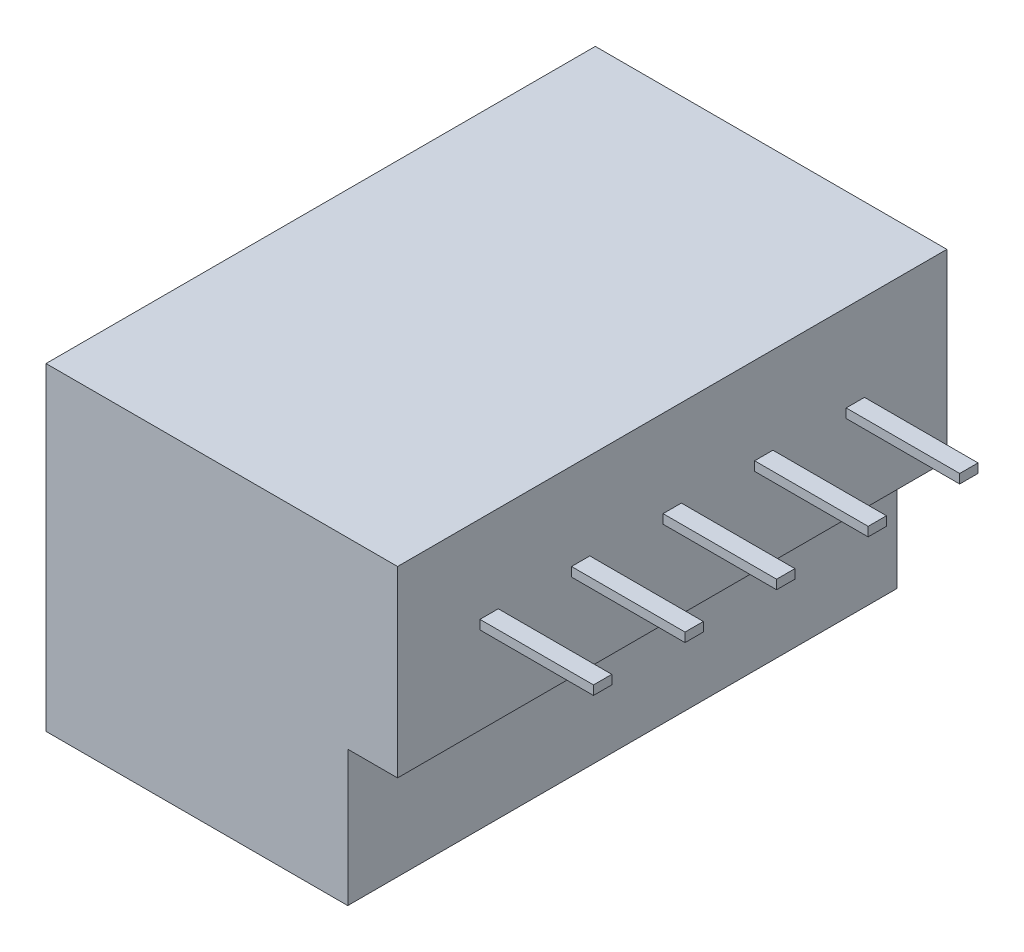
ISO-10303-21;
HEADER;
FILE_DESCRIPTION(('STEP AP214'),'2;1');
FILE_NAME('part.step','',(''),(''),'','','');
FILE_SCHEMA(('AUTOMOTIVE_DESIGN { 1 0 10303 214 1 1 1 1 }'));
ENDSEC;
DATA;
#1=APPLICATION_CONTEXT('core data for automotive mechanical design processes');
#2=APPLICATION_PROTOCOL_DEFINITION('international standard','automotive_design',2000,#1);
#3=PRODUCT_CONTEXT('',#1,'mechanical');
#4=PRODUCT('Part','Part','',(#3));
#5=PRODUCT_RELATED_PRODUCT_CATEGORY('part','',(#4));
#6=PRODUCT_DEFINITION_FORMATION('','',#4);
#7=PRODUCT_DEFINITION_CONTEXT('part definition',#1,'design');
#8=PRODUCT_DEFINITION('design','',#6,#7);
#9=PRODUCT_DEFINITION_SHAPE('','',#8);
#10=(LENGTH_UNIT() NAMED_UNIT(*) SI_UNIT(.MILLI.,.METRE.));
#11=(NAMED_UNIT(*) PLANE_ANGLE_UNIT() SI_UNIT($,.RADIAN.));
#12=(NAMED_UNIT(*) SI_UNIT($,.STERADIAN.) SOLID_ANGLE_UNIT());
#13=UNCERTAINTY_MEASURE_WITH_UNIT(LENGTH_MEASURE(1.E-05),#10,'distance_accuracy_value','');
#14=(GEOMETRIC_REPRESENTATION_CONTEXT(3) GLOBAL_UNCERTAINTY_ASSIGNED_CONTEXT((#13)) GLOBAL_UNIT_ASSIGNED_CONTEXT((#10,
#11,#12)) REPRESENTATION_CONTEXT('',''));
#15=CARTESIAN_POINT('',(0.,0.,0.));
#16=DIRECTION('',(0.,0.,1.));
#17=DIRECTION('',(1.,0.,0.));
#18=AXIS2_PLACEMENT_3D('',#15,#16,#17);
#19=CARTESIAN_POINT('',(-10.756881088162,8.7,-6.7780596006196));
#20=DIRECTION('',(-1.,0.,0.));
#21=DIRECTION('',(0.,0.,1.));
#22=AXIS2_PLACEMENT_3D('',#19,#20,#21);
#23=PLANE('',#22);
#24=DIRECTION('',(0.,-1.,0.));
#25=VECTOR('',#24,1.);
#26=CARTESIAN_POINT('',(-10.756881088162,6.325,-1.5280596006196));
#27=LINE('',#26,#25);
#28=CARTESIAN_POINT('',(-10.756881088162,6.325,-1.5280596006196));
#29=VERTEX_POINT('',#28);
#30=CARTESIAN_POINT('',(-10.756881088162,6.075,-1.5280596006196));
#31=VERTEX_POINT('',#30);
#32=EDGE_CURVE('E230',#29,#31,#27,.T.);
#33=ORIENTED_EDGE('',*,*,#32,.F.);
#34=DIRECTION('',(0.,0.,1.));
#35=VECTOR('',#34,1.);
#36=CARTESIAN_POINT('',(-10.756881088162,6.325,-1.5280596006196));
#37=LINE('',#36,#35);
#38=CARTESIAN_POINT('',(-10.756881088162,6.325,-2.0280596006196));
#39=VERTEX_POINT('',#38);
#40=EDGE_CURVE('E243',#39,#29,#37,.T.);
#41=ORIENTED_EDGE('',*,*,#40,.F.);
#42=DIRECTION('',(0.,1.,0.));
#43=VECTOR('',#42,1.);
#44=CARTESIAN_POINT('',(-10.756881088162,6.325,-2.0280596006196));
#45=LINE('',#44,#43);
#46=CARTESIAN_POINT('',(-10.756881088162,6.075,-2.0280596006196));
#47=VERTEX_POINT('',#46);
#48=EDGE_CURVE('E252',#47,#39,#45,.T.);
#49=ORIENTED_EDGE('',*,*,#48,.F.);
#50=DIRECTION('',(0.,0.,-1.));
#51=VECTOR('',#50,1.);
#52=CARTESIAN_POINT('',(-10.756881088162,6.075,-1.5280596006196));
#53=LINE('',#52,#51);
#54=EDGE_CURVE('E233',#31,#47,#53,.T.);
#55=ORIENTED_EDGE('',*,*,#54,.F.);
#56=EDGE_LOOP('',(#33,#41,#49,#55));
#57=FACE_BOUND('',#56,.T.);
#58=DIRECTION('',(0.,-1.,0.));
#59=VECTOR('',#58,1.);
#60=CARTESIAN_POINT('',(-10.756881088162,6.325,3.4719403993804));
#61=LINE('',#60,#59);
#62=CARTESIAN_POINT('',(-10.756881088162,6.325,3.4719403993804));
#63=VERTEX_POINT('',#62);
#64=CARTESIAN_POINT('',(-10.756881088162,6.075,3.4719403993804));
#65=VERTEX_POINT('',#64);
#66=EDGE_CURVE('E301',#63,#65,#61,.T.);
#67=ORIENTED_EDGE('',*,*,#66,.F.);
#68=DIRECTION('',(0.,0.,1.));
#69=VECTOR('',#68,1.);
#70=CARTESIAN_POINT('',(-10.756881088162,6.325,3.4719403993804));
#71=LINE('',#70,#69);
#72=CARTESIAN_POINT('',(-10.756881088162,6.325,2.9719403993804));
#73=VERTEX_POINT('',#72);
#74=EDGE_CURVE('E306',#73,#63,#71,.T.);
#75=ORIENTED_EDGE('',*,*,#74,.F.);
#76=DIRECTION('',(0.,1.,0.));
#77=VECTOR('',#76,1.);
#78=CARTESIAN_POINT('',(-10.756881088162,6.325,2.9719403993804));
#79=LINE('',#78,#77);
#80=CARTESIAN_POINT('',(-10.756881088162,6.075,2.9719403993804));
#81=VERTEX_POINT('',#80);
#82=EDGE_CURVE('E318',#81,#73,#79,.T.);
#83=ORIENTED_EDGE('',*,*,#82,.F.);
#84=DIRECTION('',(0.,0.,-1.));
#85=VECTOR('',#84,1.);
#86=CARTESIAN_POINT('',(-10.756881088162,6.075,3.4719403993804));
#87=LINE('',#86,#85);
#88=EDGE_CURVE('E315',#65,#81,#87,.T.);
#89=ORIENTED_EDGE('',*,*,#88,.F.);
#90=EDGE_LOOP('',(#67,#75,#83,#89));
#91=FACE_BOUND('',#90,.T.);
#92=DIRECTION('',(0.,0.,-1.));
#93=VECTOR('',#92,1.);
#94=CARTESIAN_POINT('',(-10.756881088162,3.7,-6.7780596006196));
#95=LINE('',#94,#93);
#96=CARTESIAN_POINT('',(-10.756881088162,3.7,8.2219403993804));
#97=VERTEX_POINT('',#96);
#98=CARTESIAN_POINT('',(-10.756881088162,3.7,-6.7780596006196));
#99=VERTEX_POINT('',#98);
#100=EDGE_CURVE('E382',#97,#99,#95,.T.);
#101=ORIENTED_EDGE('',*,*,#100,.T.);
#102=DIRECTION('',(0.,-1.,0.));
#103=VECTOR('',#102,1.);
#104=CARTESIAN_POINT('',(-10.756881088162,8.7,-6.7780596006196));
#105=LINE('',#104,#103);
#106=CARTESIAN_POINT('',(-10.756881088162,8.7,-6.7780596006196));
#107=VERTEX_POINT('',#106);
#108=EDGE_CURVE('E379',#107,#99,#105,.T.);
#109=ORIENTED_EDGE('',*,*,#108,.F.);
#110=DIRECTION('',(0.,0.,-1.));
#111=VECTOR('',#110,1.);
#112=CARTESIAN_POINT('',(-10.756881088162,8.7,-6.7780596006196));
#113=LINE('',#112,#111);
#114=CARTESIAN_POINT('',(-10.756881088162,8.7,8.2219403993804));
#115=VERTEX_POINT('',#114);
#116=EDGE_CURVE('E374',#115,#107,#113,.T.);
#117=ORIENTED_EDGE('',*,*,#116,.F.);
#118=DIRECTION('',(0.,-1.,0.));
#119=VECTOR('',#118,1.);
#120=CARTESIAN_POINT('',(-10.756881088162,8.7,8.2219403993804));
#121=LINE('',#120,#119);
#122=EDGE_CURVE('E417',#115,#97,#121,.T.);
#123=ORIENTED_EDGE('',*,*,#122,.T.);
#124=EDGE_LOOP('',(#101,#109,#117,#123));
#125=FACE_BOUND('',#124,.T.);
#126=DIRECTION('',(0.,-1.,0.));
#127=VECTOR('',#126,1.);
#128=CARTESIAN_POINT('',(-10.756881088162,6.325,5.9719403993804));
#129=LINE('',#128,#127);
#130=CARTESIAN_POINT('',(-10.756881088162,6.325,5.9719403993804));
#131=VERTEX_POINT('',#130);
#132=CARTESIAN_POINT('',(-10.756881088162,6.075,5.9719403993804));
#133=VERTEX_POINT('',#132);
#134=EDGE_CURVE('E334',#131,#133,#129,.T.);
#135=ORIENTED_EDGE('',*,*,#134,.F.);
#136=DIRECTION('',(0.,0.,1.));
#137=VECTOR('',#136,1.);
#138=CARTESIAN_POINT('',(-10.756881088162,6.325,5.9719403993804));
#139=LINE('',#138,#137);
#140=CARTESIAN_POINT('',(-10.756881088162,6.325,5.4719403993804));
#141=VERTEX_POINT('',#140);
#142=EDGE_CURVE('E339',#141,#131,#139,.T.);
#143=ORIENTED_EDGE('',*,*,#142,.F.);
#144=DIRECTION('',(0.,1.,0.));
#145=VECTOR('',#144,1.);
#146=CARTESIAN_POINT('',(-10.756881088162,6.325,5.4719403993804));
#147=LINE('',#146,#145);
#148=CARTESIAN_POINT('',(-10.756881088162,6.075,5.4719403993804));
#149=VERTEX_POINT('',#148);
#150=EDGE_CURVE('E351',#149,#141,#147,.T.);
#151=ORIENTED_EDGE('',*,*,#150,.F.);
#152=DIRECTION('',(0.,0.,-1.));
#153=VECTOR('',#152,1.);
#154=CARTESIAN_POINT('',(-10.756881088162,6.075,5.9719403993804));
#155=LINE('',#154,#153);
#156=EDGE_CURVE('E348',#133,#149,#155,.T.);
#157=ORIENTED_EDGE('',*,*,#156,.F.);
#158=EDGE_LOOP('',(#135,#143,#151,#157));
#159=FACE_BOUND('',#158,.T.);
#160=DIRECTION('',(0.,-1.,0.));
#161=VECTOR('',#160,1.);
#162=CARTESIAN_POINT('',(-10.756881088162,6.325,0.971940399380402));
#163=LINE('',#162,#161);
#164=CARTESIAN_POINT('',(-10.756881088162,6.325,0.971940399380402));
#165=VERTEX_POINT('',#164);
#166=CARTESIAN_POINT('',(-10.756881088162,6.075,0.971940399380402));
#167=VERTEX_POINT('',#166);
#168=EDGE_CURVE('E268',#165,#167,#163,.T.);
#169=ORIENTED_EDGE('',*,*,#168,.F.);
#170=DIRECTION('',(0.,0.,1.));
#171=VECTOR('',#170,1.);
#172=CARTESIAN_POINT('',(-10.756881088162,6.325,0.971940399380402));
#173=LINE('',#172,#171);
#174=CARTESIAN_POINT('',(-10.756881088162,6.325,0.471940399380401));
#175=VERTEX_POINT('',#174);
#176=EDGE_CURVE('E273',#175,#165,#173,.T.);
#177=ORIENTED_EDGE('',*,*,#176,.F.);
#178=DIRECTION('',(0.,1.,0.));
#179=VECTOR('',#178,1.);
#180=CARTESIAN_POINT('',(-10.756881088162,6.325,0.471940399380402));
#181=LINE('',#180,#179);
#182=CARTESIAN_POINT('',(-10.756881088162,6.075,0.471940399380402));
#183=VERTEX_POINT('',#182);
#184=EDGE_CURVE('E285',#183,#175,#181,.T.);
#185=ORIENTED_EDGE('',*,*,#184,.F.);
#186=DIRECTION('',(0.,0.,-1.));
#187=VECTOR('',#186,1.);
#188=CARTESIAN_POINT('',(-10.756881088162,6.075,0.971940399380402));
#189=LINE('',#188,#187);
#190=EDGE_CURVE('E282',#167,#183,#189,.T.);
#191=ORIENTED_EDGE('',*,*,#190,.F.);
#192=EDGE_LOOP('',(#169,#177,#185,#191));
#193=FACE_BOUND('',#192,.T.);
#194=DIRECTION('',(0.,-1.,0.));
#195=VECTOR('',#194,1.);
#196=CARTESIAN_POINT('',(-10.756881088162,6.325,-4.0280596006196));
#197=LINE('',#196,#195);
#198=CARTESIAN_POINT('',(-10.756881088162,6.325,-4.0280596006196));
#199=VERTEX_POINT('',#198);
#200=CARTESIAN_POINT('',(-10.756881088162,6.075,-4.0280596006196));
#201=VERTEX_POINT('',#200);
#202=EDGE_CURVE('E229',#199,#201,#197,.T.);
#203=ORIENTED_EDGE('',*,*,#202,.F.);
#204=DIRECTION('',(0.,0.,1.));
#205=VECTOR('',#204,1.);
#206=CARTESIAN_POINT('',(-10.756881088162,6.325,-4.0280596006196));
#207=LINE('',#206,#205);
#208=CARTESIAN_POINT('',(-10.756881088162,6.325,-4.5280596006196));
#209=VERTEX_POINT('',#208);
#210=EDGE_CURVE('E226',#209,#199,#207,.T.);
#211=ORIENTED_EDGE('',*,*,#210,.F.);
#212=DIRECTION('',(0.,1.,0.));
#213=VECTOR('',#212,1.);
#214=CARTESIAN_POINT('',(-10.756881088162,6.325,-4.5280596006196));
#215=LINE('',#214,#213);
#216=CARTESIAN_POINT('',(-10.756881088162,6.075,-4.5280596006196));
#217=VERTEX_POINT('',#216);
#218=EDGE_CURVE('E56',#217,#209,#215,.T.);
#219=ORIENTED_EDGE('',*,*,#218,.F.);
#220=DIRECTION('',(0.,0.,-1.));
#221=VECTOR('',#220,1.);
#222=CARTESIAN_POINT('',(-10.756881088162,6.075,-4.0280596006196));
#223=LINE('',#222,#221);
#224=EDGE_CURVE('E51',#201,#217,#223,.T.);
#225=ORIENTED_EDGE('',*,*,#224,.F.);
#226=EDGE_LOOP('',(#203,#211,#219,#225));
#227=FACE_BOUND('',#226,.T.);
#228=ADVANCED_FACE('F34',(#57,#91,#125,#159,#193,#227),#23,.F.);
#229=CARTESIAN_POINT('',(-20.356881088162,3.7,-6.7780596006196));
#230=DIRECTION('',(1.,0.,0.));
#231=DIRECTION('',(0.,0.,-1.));
#232=AXIS2_PLACEMENT_3D('',#229,#230,#231);
#233=PLANE('',#232);
#234=DIRECTION('',(0.,0.,1.));
#235=VECTOR('',#234,1.);
#236=CARTESIAN_POINT('',(-20.356881088162,0.,-6.7780596006196));
#237=LINE('',#236,#235);
#238=CARTESIAN_POINT('',(-20.356881088162,0.,-6.7780596006196));
#239=VERTEX_POINT('',#238);
#240=CARTESIAN_POINT('',(-20.356881088162,0.,8.2219403993804));
#241=VERTEX_POINT('',#240);
#242=EDGE_CURVE('E390',#239,#241,#237,.T.);
#243=ORIENTED_EDGE('',*,*,#242,.T.);
#244=DIRECTION('',(0.,-1.,0.));
#245=VECTOR('',#244,1.);
#246=CARTESIAN_POINT('',(-20.356881088162,3.7,8.2219403993804));
#247=LINE('',#246,#245);
#248=CARTESIAN_POINT('',(-20.356881088162,8.7,8.2219403993804));
#249=VERTEX_POINT('',#248);
#250=EDGE_CURVE('E11',#249,#241,#247,.T.);
#251=ORIENTED_EDGE('',*,*,#250,.F.);
#252=DIRECTION('',(0.,0.,1.));
#253=VECTOR('',#252,1.);
#254=CARTESIAN_POINT('',(-20.356881088162,8.7,8.2219403993804));
#255=LINE('',#254,#253);
#256=CARTESIAN_POINT('',(-20.356881088162,8.7,-6.7780596006196));
#257=VERTEX_POINT('',#256);
#258=EDGE_CURVE('E368',#257,#249,#255,.T.);
#259=ORIENTED_EDGE('',*,*,#258,.F.);
#260=DIRECTION('',(0.,-1.,0.));
#261=VECTOR('',#260,1.);
#262=CARTESIAN_POINT('',(-20.356881088162,3.7,-6.7780596006196));
#263=LINE('',#262,#261);
#264=EDGE_CURVE('E396',#257,#239,#263,.T.);
#265=ORIENTED_EDGE('',*,*,#264,.T.);
#266=EDGE_LOOP('',(#243,#251,#259,#265));
#267=FACE_BOUND('',#266,.T.);
#268=ADVANCED_FACE('F36',(#267),#233,.F.);
#269=CARTESIAN_POINT('',(-20.356881088162,3.7,8.2219403993804));
#270=DIRECTION('',(0.,0.,-1.));
#271=DIRECTION('',(-1.,0.,0.));
#272=AXIS2_PLACEMENT_3D('',#269,#270,#271);
#273=PLANE('',#272);
#274=DIRECTION('',(1.,0.,0.));
#275=VECTOR('',#274,1.);
#276=CARTESIAN_POINT('',(-20.356881088162,0.,8.2219403993804));
#277=LINE('',#276,#275);
#278=CARTESIAN_POINT('',(-12.116881088162,0.,8.2219403993804));
#279=VERTEX_POINT('',#278);
#280=EDGE_CURVE('E414',#241,#279,#277,.T.);
#281=ORIENTED_EDGE('',*,*,#280,.T.);
#282=DIRECTION('',(0.,-1.,0.));
#283=VECTOR('',#282,1.);
#284=CARTESIAN_POINT('',(-12.116881088162,3.7,8.2219403993804));
#285=LINE('',#284,#283);
#286=CARTESIAN_POINT('',(-12.116881088162,3.7,8.2219403993804));
#287=VERTEX_POINT('',#286);
#288=EDGE_CURVE('E43',#287,#279,#285,.T.);
#289=ORIENTED_EDGE('',*,*,#288,.F.);
#290=DIRECTION('',(1.,0.,0.));
#291=VECTOR('',#290,1.);
#292=CARTESIAN_POINT('',(-12.116881088162,3.7,8.2219403993804));
#293=LINE('',#292,#291);
#294=EDGE_CURVE('E367',#287,#97,#293,.T.);
#295=ORIENTED_EDGE('',*,*,#294,.T.);
#296=ORIENTED_EDGE('',*,*,#122,.F.);
#297=DIRECTION('',(1.,0.,0.));
#298=VECTOR('',#297,1.);
#299=CARTESIAN_POINT('',(-20.356881088162,8.7,8.2219403993804));
#300=LINE('',#299,#298);
#301=EDGE_CURVE('E371',#249,#115,#300,.T.);
#302=ORIENTED_EDGE('',*,*,#301,.F.);
#303=ORIENTED_EDGE('',*,*,#250,.T.);
#304=EDGE_LOOP('',(#281,#289,#295,#296,#302,#303));
#305=FACE_BOUND('',#304,.T.);
#306=ADVANCED_FACE('F443',(#305),#273,.F.);
#307=CARTESIAN_POINT('',(-12.116881088162,3.7,-6.7780596006196));
#308=DIRECTION('',(-1.,0.,0.));
#309=DIRECTION('',(0.,0.,1.));
#310=AXIS2_PLACEMENT_3D('',#307,#308,#309);
#311=PLANE('',#310);
#312=DIRECTION('',(0.,0.,-1.));
#313=VECTOR('',#312,1.);
#314=CARTESIAN_POINT('',(-12.116881088162,0.,-6.7780596006196));
#315=LINE('',#314,#313);
#316=CARTESIAN_POINT('',(-12.116881088162,0.,-6.7780596006196));
#317=VERTEX_POINT('',#316);
#318=EDGE_CURVE('E413',#279,#317,#315,.T.);
#319=ORIENTED_EDGE('',*,*,#318,.T.);
#320=DIRECTION('',(0.,-1.,0.));
#321=VECTOR('',#320,1.);
#322=CARTESIAN_POINT('',(-12.116881088162,3.7,-6.7780596006196));
#323=LINE('',#322,#321);
#324=CARTESIAN_POINT('',(-12.116881088162,3.7,-6.7780596006196));
#325=VERTEX_POINT('',#324);
#326=EDGE_CURVE('E401',#325,#317,#323,.T.);
#327=ORIENTED_EDGE('',*,*,#326,.F.);
#328=DIRECTION('',(0.,0.,-1.));
#329=VECTOR('',#328,1.);
#330=CARTESIAN_POINT('',(-12.116881088162,3.7,-6.7780596006196));
#331=LINE('',#330,#329);
#332=EDGE_CURVE('E393',#287,#325,#331,.T.);
#333=ORIENTED_EDGE('',*,*,#332,.F.);
#334=ORIENTED_EDGE('',*,*,#288,.T.);
#335=EDGE_LOOP('',(#319,#327,#333,#334));
#336=FACE_BOUND('',#335,.T.);
#337=ADVANCED_FACE('F436',(#336),#311,.F.);
#338=CARTESIAN_POINT('',(-20.356881088162,3.7,-6.7780596006196));
#339=DIRECTION('',(0.,0.,1.));
#340=DIRECTION('',(1.,0.,0.));
#341=AXIS2_PLACEMENT_3D('',#338,#339,#340);
#342=PLANE('',#341);
#343=DIRECTION('',(-1.,0.,0.));
#344=VECTOR('',#343,1.);
#345=CARTESIAN_POINT('',(-20.356881088162,0.,-6.7780596006196));
#346=LINE('',#345,#344);
#347=EDGE_CURVE('E397',#317,#239,#346,.T.);
#348=ORIENTED_EDGE('',*,*,#347,.T.);
#349=ORIENTED_EDGE('',*,*,#264,.F.);
#350=DIRECTION('',(-1.,0.,0.));
#351=VECTOR('',#350,1.);
#352=CARTESIAN_POINT('',(-12.116881088162,8.7,-6.7780596006196));
#353=LINE('',#352,#351);
#354=EDGE_CURVE('E376',#107,#257,#353,.T.);
#355=ORIENTED_EDGE('',*,*,#354,.F.);
#356=ORIENTED_EDGE('',*,*,#108,.T.);
#357=DIRECTION('',(-1.,0.,0.));
#358=VECTOR('',#357,1.);
#359=CARTESIAN_POINT('',(-20.356881088162,3.7,-6.7780596006196));
#360=LINE('',#359,#358);
#361=EDGE_CURVE('E372',#99,#325,#360,.T.);
#362=ORIENTED_EDGE('',*,*,#361,.T.);
#363=ORIENTED_EDGE('',*,*,#326,.T.);
#364=EDGE_LOOP('',(#348,#349,#355,#356,#362,#363));
#365=FACE_BOUND('',#364,.T.);
#366=ADVANCED_FACE('F431',(#365),#342,.F.);
#367=CARTESIAN_POINT('',(0.,0.,0.));
#368=DIRECTION('',(0.,1.,0.));
#369=DIRECTION('',(0.,0.,1.));
#370=AXIS2_PLACEMENT_3D('',#367,#368,#369);
#371=PLANE('',#370);
#372=CARTESIAN_POINT('',(-16.236881088162,0.,-3.2780596006196));
#373=DIRECTION('',(0.,-1.,0.));
#374=DIRECTION('',(0.,0.,-1.));
#375=AXIS2_PLACEMENT_3D('',#372,#373,#374);
#376=CIRCLE('',#375,2.);
#377=CARTESIAN_POINT('',(-16.236881088162,0.,-5.2780596006196));
#378=VERTEX_POINT('',#377);
#379=EDGE_CURVE('E866',#378,#378,#376,.T.);
#380=ORIENTED_EDGE('',*,*,#379,.F.);
#381=EDGE_LOOP('',(#380));
#382=FACE_BOUND('',#381,.T.);
#383=CARTESIAN_POINT('',(-16.236881088162,0.,4.7219403993804));
#384=DIRECTION('',(0.,-1.,0.));
#385=DIRECTION('',(0.,0.,-1.));
#386=AXIS2_PLACEMENT_3D('',#383,#384,#385);
#387=CIRCLE('',#386,2.25);
#388=CARTESIAN_POINT('',(-16.236881088162,0.,2.4719403993804));
#389=VERTEX_POINT('',#388);
#390=EDGE_CURVE('E865',#389,#389,#387,.T.);
#391=ORIENTED_EDGE('',*,*,#390,.F.);
#392=EDGE_LOOP('',(#391));
#393=FACE_BOUND('',#392,.T.);
#394=ORIENTED_EDGE('',*,*,#242,.F.);
#395=ORIENTED_EDGE('',*,*,#347,.F.);
#396=ORIENTED_EDGE('',*,*,#318,.F.);
#397=ORIENTED_EDGE('',*,*,#280,.F.);
#398=EDGE_LOOP('',(#394,#395,#396,#397));
#399=FACE_BOUND('',#398,.T.);
#400=ADVANCED_FACE('F438',(#382,#393,#399),#371,.F.);
#401=CARTESIAN_POINT('',(0.,8.7,0.));
#402=DIRECTION('',(0.,-1.,0.));
#403=DIRECTION('',(0.,0.,-1.));
#404=AXIS2_PLACEMENT_3D('',#401,#402,#403);
#405=PLANE('',#404);
#406=ORIENTED_EDGE('',*,*,#258,.T.);
#407=ORIENTED_EDGE('',*,*,#301,.T.);
#408=ORIENTED_EDGE('',*,*,#116,.T.);
#409=ORIENTED_EDGE('',*,*,#354,.T.);
#410=EDGE_LOOP('',(#406,#407,#408,#409));
#411=FACE_BOUND('',#410,.T.);
#412=ADVANCED_FACE('F442',(#411),#405,.F.);
#413=CARTESIAN_POINT('',(0.,3.7,0.));
#414=DIRECTION('',(0.,-1.,0.));
#415=DIRECTION('',(0.,0.,-1.));
#416=AXIS2_PLACEMENT_3D('',#413,#414,#415);
#417=PLANE('',#416);
#418=ORIENTED_EDGE('',*,*,#294,.F.);
#419=ORIENTED_EDGE('',*,*,#332,.T.);
#420=ORIENTED_EDGE('',*,*,#361,.F.);
#421=ORIENTED_EDGE('',*,*,#100,.F.);
#422=EDGE_LOOP('',(#418,#419,#420,#421));
#423=FACE_BOUND('',#422,.T.);
#424=ADVANCED_FACE('F435',(#423),#417,.T.);
#425=CARTESIAN_POINT('',(-7.65688108816203,6.325,5.9719403993804));
#426=DIRECTION('',(0.,0.,-1.));
#427=DIRECTION('',(-1.,0.,0.));
#428=AXIS2_PLACEMENT_3D('',#425,#426,#427);
#429=PLANE('',#428);
#430=ORIENTED_EDGE('',*,*,#134,.T.);
#431=DIRECTION('',(-1.,0.,0.));
#432=VECTOR('',#431,1.);
#433=CARTESIAN_POINT('',(-7.65688108816203,6.075,5.9719403993804));
#434=LINE('',#433,#432);
#435=CARTESIAN_POINT('',(-7.65688108816203,6.075,5.9719403993804));
#436=VERTEX_POINT('',#435);
#437=EDGE_CURVE('E364',#436,#133,#434,.T.);
#438=ORIENTED_EDGE('',*,*,#437,.F.);
#439=DIRECTION('',(0.,-1.,0.));
#440=VECTOR('',#439,1.);
#441=CARTESIAN_POINT('',(-7.65688108816203,6.325,5.9719403993804));
#442=LINE('',#441,#440);
#443=CARTESIAN_POINT('',(-7.65688108816203,6.325,5.9719403993804));
#444=VERTEX_POINT('',#443);
#445=EDGE_CURVE('E335',#444,#436,#442,.T.);
#446=ORIENTED_EDGE('',*,*,#445,.F.);
#447=DIRECTION('',(-1.,0.,0.));
#448=VECTOR('',#447,1.);
#449=CARTESIAN_POINT('',(-7.65688108816203,6.325,5.9719403993804));
#450=LINE('',#449,#448);
#451=EDGE_CURVE('E345',#444,#131,#450,.T.);
#452=ORIENTED_EDGE('',*,*,#451,.T.);
#453=EDGE_LOOP('',(#430,#438,#446,#452));
#454=FACE_BOUND('',#453,.T.);
#455=ADVANCED_FACE('F484',(#454),#429,.F.);
#456=CARTESIAN_POINT('',(-7.65688108816203,6.075,5.9719403993804));
#457=DIRECTION('',(0.,1.,0.));
#458=DIRECTION('',(0.,0.,1.));
#459=AXIS2_PLACEMENT_3D('',#456,#457,#458);
#460=PLANE('',#459);
#461=ORIENTED_EDGE('',*,*,#156,.T.);
#462=DIRECTION('',(-1.,0.,0.));
#463=VECTOR('',#462,1.);
#464=CARTESIAN_POINT('',(-7.65688108816203,6.075,5.4719403993804));
#465=LINE('',#464,#463);
#466=CARTESIAN_POINT('',(-7.65688108816203,6.075,5.4719403993804));
#467=VERTEX_POINT('',#466);
#468=EDGE_CURVE('E361',#467,#149,#465,.T.);
#469=ORIENTED_EDGE('',*,*,#468,.F.);
#470=DIRECTION('',(0.,0.,-1.));
#471=VECTOR('',#470,1.);
#472=CARTESIAN_POINT('',(-7.65688108816203,6.075,5.9719403993804));
#473=LINE('',#472,#471);
#474=EDGE_CURVE('E338',#436,#467,#473,.T.);
#475=ORIENTED_EDGE('',*,*,#474,.F.);
#476=ORIENTED_EDGE('',*,*,#437,.T.);
#477=EDGE_LOOP('',(#461,#469,#475,#476));
#478=FACE_BOUND('',#477,.T.);
#479=ADVANCED_FACE('F490',(#478),#460,.F.);
#480=CARTESIAN_POINT('',(-7.65688108816203,6.325,5.4719403993804));
#481=DIRECTION('',(0.,0.,1.));
#482=DIRECTION('',(1.,0.,0.));
#483=AXIS2_PLACEMENT_3D('',#480,#481,#482);
#484=PLANE('',#483);
#485=ORIENTED_EDGE('',*,*,#150,.T.);
#486=DIRECTION('',(-1.,0.,0.));
#487=VECTOR('',#486,1.);
#488=CARTESIAN_POINT('',(-7.65688108816203,6.325,5.4719403993804));
#489=LINE('',#488,#487);
#490=CARTESIAN_POINT('',(-7.65688108816203,6.325,5.4719403993804));
#491=VERTEX_POINT('',#490);
#492=EDGE_CURVE('E358',#491,#141,#489,.T.);
#493=ORIENTED_EDGE('',*,*,#492,.F.);
#494=DIRECTION('',(0.,1.,0.));
#495=VECTOR('',#494,1.);
#496=CARTESIAN_POINT('',(-7.65688108816203,6.325,5.4719403993804));
#497=LINE('',#496,#495);
#498=EDGE_CURVE('E341',#467,#491,#497,.T.);
#499=ORIENTED_EDGE('',*,*,#498,.F.);
#500=ORIENTED_EDGE('',*,*,#468,.T.);
#501=EDGE_LOOP('',(#485,#493,#499,#500));
#502=FACE_BOUND('',#501,.T.);
#503=ADVANCED_FACE('F499',(#502),#484,.F.);
#504=CARTESIAN_POINT('',(-7.65688108816203,6.325,5.9719403993804));
#505=DIRECTION('',(0.,-1.,0.));
#506=DIRECTION('',(0.,0.,-1.));
#507=AXIS2_PLACEMENT_3D('',#504,#505,#506);
#508=PLANE('',#507);
#509=ORIENTED_EDGE('',*,*,#142,.T.);
#510=ORIENTED_EDGE('',*,*,#451,.F.);
#511=DIRECTION('',(0.,0.,1.));
#512=VECTOR('',#511,1.);
#513=CARTESIAN_POINT('',(-7.65688108816203,6.325,5.9719403993804));
#514=LINE('',#513,#512);
#515=EDGE_CURVE('E343',#491,#444,#514,.T.);
#516=ORIENTED_EDGE('',*,*,#515,.F.);
#517=ORIENTED_EDGE('',*,*,#492,.T.);
#518=EDGE_LOOP('',(#509,#510,#516,#517));
#519=FACE_BOUND('',#518,.T.);
#520=ADVANCED_FACE('F508',(#519),#508,.F.);
#521=CARTESIAN_POINT('',(-7.65688108816203,0.,0.));
#522=DIRECTION('',(1.,0.,0.));
#523=DIRECTION('',(0.,0.,-1.));
#524=AXIS2_PLACEMENT_3D('',#521,#522,#523);
#525=PLANE('',#524);
#526=ORIENTED_EDGE('',*,*,#445,.T.);
#527=ORIENTED_EDGE('',*,*,#474,.T.);
#528=ORIENTED_EDGE('',*,*,#498,.T.);
#529=ORIENTED_EDGE('',*,*,#515,.T.);
#530=EDGE_LOOP('',(#526,#527,#528,#529));
#531=FACE_BOUND('',#530,.T.);
#532=ADVANCED_FACE('F516',(#531),#525,.T.);
#533=CARTESIAN_POINT('',(-7.65688108816203,6.325,3.4719403993804));
#534=DIRECTION('',(0.,0.,-1.));
#535=DIRECTION('',(-1.,0.,0.));
#536=AXIS2_PLACEMENT_3D('',#533,#534,#535);
#537=PLANE('',#536);
#538=ORIENTED_EDGE('',*,*,#66,.T.);
#539=DIRECTION('',(-1.,0.,0.));
#540=VECTOR('',#539,1.);
#541=CARTESIAN_POINT('',(-7.65688108816203,6.075,3.4719403993804));
#542=LINE('',#541,#540);
#543=CARTESIAN_POINT('',(-7.65688108816203,6.075,3.4719403993804));
#544=VERTEX_POINT('',#543);
#545=EDGE_CURVE('E331',#544,#65,#542,.T.);
#546=ORIENTED_EDGE('',*,*,#545,.F.);
#547=DIRECTION('',(0.,-1.,0.));
#548=VECTOR('',#547,1.);
#549=CARTESIAN_POINT('',(-7.65688108816203,6.325,3.4719403993804));
#550=LINE('',#549,#548);
#551=CARTESIAN_POINT('',(-7.65688108816203,6.325,3.4719403993804));
#552=VERTEX_POINT('',#551);
#553=EDGE_CURVE('E302',#552,#544,#550,.T.);
#554=ORIENTED_EDGE('',*,*,#553,.F.);
#555=DIRECTION('',(-1.,0.,0.));
#556=VECTOR('',#555,1.);
#557=CARTESIAN_POINT('',(-7.65688108816203,6.325,3.4719403993804));
#558=LINE('',#557,#556);
#559=EDGE_CURVE('E312',#552,#63,#558,.T.);
#560=ORIENTED_EDGE('',*,*,#559,.T.);
#561=EDGE_LOOP('',(#538,#546,#554,#560));
#562=FACE_BOUND('',#561,.T.);
#563=ADVANCED_FACE('F524',(#562),#537,.F.);
#564=CARTESIAN_POINT('',(-7.65688108816203,6.075,3.4719403993804));
#565=DIRECTION('',(0.,1.,0.));
#566=DIRECTION('',(0.,0.,1.));
#567=AXIS2_PLACEMENT_3D('',#564,#565,#566);
#568=PLANE('',#567);
#569=ORIENTED_EDGE('',*,*,#88,.T.);
#570=DIRECTION('',(-1.,0.,0.));
#571=VECTOR('',#570,1.);
#572=CARTESIAN_POINT('',(-7.65688108816203,6.075,2.9719403993804));
#573=LINE('',#572,#571);
#574=CARTESIAN_POINT('',(-7.65688108816203,6.075,2.9719403993804));
#575=VERTEX_POINT('',#574);
#576=EDGE_CURVE('E328',#575,#81,#573,.T.);
#577=ORIENTED_EDGE('',*,*,#576,.F.);
#578=DIRECTION('',(0.,0.,-1.));
#579=VECTOR('',#578,1.);
#580=CARTESIAN_POINT('',(-7.65688108816203,6.075,3.4719403993804));
#581=LINE('',#580,#579);
#582=EDGE_CURVE('E305',#544,#575,#581,.T.);
#583=ORIENTED_EDGE('',*,*,#582,.F.);
#584=ORIENTED_EDGE('',*,*,#545,.T.);
#585=EDGE_LOOP('',(#569,#577,#583,#584));
#586=FACE_BOUND('',#585,.T.);
#587=ADVANCED_FACE('F532',(#586),#568,.F.);
#588=CARTESIAN_POINT('',(-7.65688108816203,6.325,2.9719403993804));
#589=DIRECTION('',(0.,0.,1.));
#590=DIRECTION('',(1.,0.,0.));
#591=AXIS2_PLACEMENT_3D('',#588,#589,#590);
#592=PLANE('',#591);
#593=ORIENTED_EDGE('',*,*,#82,.T.);
#594=DIRECTION('',(-1.,0.,0.));
#595=VECTOR('',#594,1.);
#596=CARTESIAN_POINT('',(-7.65688108816203,6.325,2.9719403993804));
#597=LINE('',#596,#595);
#598=CARTESIAN_POINT('',(-7.65688108816203,6.325,2.9719403993804));
#599=VERTEX_POINT('',#598);
#600=EDGE_CURVE('E325',#599,#73,#597,.T.);
#601=ORIENTED_EDGE('',*,*,#600,.F.);
#602=DIRECTION('',(0.,1.,0.));
#603=VECTOR('',#602,1.);
#604=CARTESIAN_POINT('',(-7.65688108816203,6.325,2.9719403993804));
#605=LINE('',#604,#603);
#606=EDGE_CURVE('E308',#575,#599,#605,.T.);
#607=ORIENTED_EDGE('',*,*,#606,.F.);
#608=ORIENTED_EDGE('',*,*,#576,.T.);
#609=EDGE_LOOP('',(#593,#601,#607,#608));
#610=FACE_BOUND('',#609,.T.);
#611=ADVANCED_FACE('F542',(#610),#592,.F.);
#612=CARTESIAN_POINT('',(-7.65688108816203,6.325,3.4719403993804));
#613=DIRECTION('',(0.,-1.,0.));
#614=DIRECTION('',(0.,0.,-1.));
#615=AXIS2_PLACEMENT_3D('',#612,#613,#614);
#616=PLANE('',#615);
#617=ORIENTED_EDGE('',*,*,#74,.T.);
#618=ORIENTED_EDGE('',*,*,#559,.F.);
#619=DIRECTION('',(0.,0.,1.));
#620=VECTOR('',#619,1.);
#621=CARTESIAN_POINT('',(-7.65688108816203,6.325,3.4719403993804));
#622=LINE('',#621,#620);
#623=EDGE_CURVE('E310',#599,#552,#622,.T.);
#624=ORIENTED_EDGE('',*,*,#623,.F.);
#625=ORIENTED_EDGE('',*,*,#600,.T.);
#626=EDGE_LOOP('',(#617,#618,#624,#625));
#627=FACE_BOUND('',#626,.T.);
#628=ADVANCED_FACE('F550',(#627),#616,.F.);
#629=CARTESIAN_POINT('',(-7.65688108816203,0.,0.));
#630=DIRECTION('',(1.,0.,0.));
#631=DIRECTION('',(0.,0.,-1.));
#632=AXIS2_PLACEMENT_3D('',#629,#630,#631);
#633=PLANE('',#632);
#634=ORIENTED_EDGE('',*,*,#553,.T.);
#635=ORIENTED_EDGE('',*,*,#582,.T.);
#636=ORIENTED_EDGE('',*,*,#606,.T.);
#637=ORIENTED_EDGE('',*,*,#623,.T.);
#638=EDGE_LOOP('',(#634,#635,#636,#637));
#639=FACE_BOUND('',#638,.T.);
#640=ADVANCED_FACE('F557',(#639),#633,.T.);
#641=CARTESIAN_POINT('',(-7.65688108816203,6.325,0.971940399380401));
#642=DIRECTION('',(0.,0.,-1.));
#643=DIRECTION('',(-1.,0.,0.));
#644=AXIS2_PLACEMENT_3D('',#641,#642,#643);
#645=PLANE('',#644);
#646=ORIENTED_EDGE('',*,*,#168,.T.);
#647=DIRECTION('',(-1.,0.,0.));
#648=VECTOR('',#647,1.);
#649=CARTESIAN_POINT('',(-7.65688108816203,6.075,0.971940399380401));
#650=LINE('',#649,#648);
#651=CARTESIAN_POINT('',(-7.65688108816203,6.075,0.971940399380401));
#652=VERTEX_POINT('',#651);
#653=EDGE_CURVE('E298',#652,#167,#650,.T.);
#654=ORIENTED_EDGE('',*,*,#653,.F.);
#655=DIRECTION('',(0.,-1.,0.));
#656=VECTOR('',#655,1.);
#657=CARTESIAN_POINT('',(-7.65688108816203,6.325,0.971940399380401));
#658=LINE('',#657,#656);
#659=CARTESIAN_POINT('',(-7.65688108816203,6.325,0.971940399380401));
#660=VERTEX_POINT('',#659);
#661=EDGE_CURVE('E269',#660,#652,#658,.T.);
#662=ORIENTED_EDGE('',*,*,#661,.F.);
#663=DIRECTION('',(-1.,0.,0.));
#664=VECTOR('',#663,1.);
#665=CARTESIAN_POINT('',(-7.65688108816203,6.325,0.971940399380401));
#666=LINE('',#665,#664);
#667=EDGE_CURVE('E279',#660,#165,#666,.T.);
#668=ORIENTED_EDGE('',*,*,#667,.T.);
#669=EDGE_LOOP('',(#646,#654,#662,#668));
#670=FACE_BOUND('',#669,.T.);
#671=ADVANCED_FACE('F564',(#670),#645,.F.);
#672=CARTESIAN_POINT('',(-7.65688108816203,6.075,0.971940399380401));
#673=DIRECTION('',(0.,1.,0.));
#674=DIRECTION('',(0.,0.,1.));
#675=AXIS2_PLACEMENT_3D('',#672,#673,#674);
#676=PLANE('',#675);
#677=ORIENTED_EDGE('',*,*,#190,.T.);
#678=DIRECTION('',(-1.,0.,0.));
#679=VECTOR('',#678,1.);
#680=CARTESIAN_POINT('',(-7.65688108816203,6.075,0.471940399380401));
#681=LINE('',#680,#679);
#682=CARTESIAN_POINT('',(-7.65688108816203,6.075,0.471940399380401));
#683=VERTEX_POINT('',#682);
#684=EDGE_CURVE('E295',#683,#183,#681,.T.);
#685=ORIENTED_EDGE('',*,*,#684,.F.);
#686=DIRECTION('',(0.,0.,-1.));
#687=VECTOR('',#686,1.);
#688=CARTESIAN_POINT('',(-7.65688108816203,6.075,0.971940399380401));
#689=LINE('',#688,#687);
#690=EDGE_CURVE('E272',#652,#683,#689,.T.);
#691=ORIENTED_EDGE('',*,*,#690,.F.);
#692=ORIENTED_EDGE('',*,*,#653,.T.);
#693=EDGE_LOOP('',(#677,#685,#691,#692));
#694=FACE_BOUND('',#693,.T.);
#695=ADVANCED_FACE('F571',(#694),#676,.F.);
#696=CARTESIAN_POINT('',(-7.65688108816203,6.325,0.471940399380401));
#697=DIRECTION('',(0.,0.,1.));
#698=DIRECTION('',(1.,0.,0.));
#699=AXIS2_PLACEMENT_3D('',#696,#697,#698);
#700=PLANE('',#699);
#701=ORIENTED_EDGE('',*,*,#184,.T.);
#702=DIRECTION('',(-1.,0.,0.));
#703=VECTOR('',#702,1.);
#704=CARTESIAN_POINT('',(-7.65688108816203,6.325,0.471940399380401));
#705=LINE('',#704,#703);
#706=CARTESIAN_POINT('',(-7.65688108816203,6.325,0.471940399380401));
#707=VERTEX_POINT('',#706);
#708=EDGE_CURVE('E292',#707,#175,#705,.T.);
#709=ORIENTED_EDGE('',*,*,#708,.F.);
#710=DIRECTION('',(0.,1.,0.));
#711=VECTOR('',#710,1.);
#712=CARTESIAN_POINT('',(-7.65688108816203,6.325,0.471940399380401));
#713=LINE('',#712,#711);
#714=EDGE_CURVE('E275',#683,#707,#713,.T.);
#715=ORIENTED_EDGE('',*,*,#714,.F.);
#716=ORIENTED_EDGE('',*,*,#684,.T.);
#717=EDGE_LOOP('',(#701,#709,#715,#716));
#718=FACE_BOUND('',#717,.T.);
#719=ADVANCED_FACE('F579',(#718),#700,.F.);
#720=CARTESIAN_POINT('',(-7.65688108816203,6.325,0.971940399380401));
#721=DIRECTION('',(0.,-1.,0.));
#722=DIRECTION('',(0.,0.,-1.));
#723=AXIS2_PLACEMENT_3D('',#720,#721,#722);
#724=PLANE('',#723);
#725=ORIENTED_EDGE('',*,*,#176,.T.);
#726=ORIENTED_EDGE('',*,*,#667,.F.);
#727=DIRECTION('',(0.,0.,1.));
#728=VECTOR('',#727,1.);
#729=CARTESIAN_POINT('',(-7.65688108816203,6.325,0.971940399380401));
#730=LINE('',#729,#728);
#731=EDGE_CURVE('E277',#707,#660,#730,.T.);
#732=ORIENTED_EDGE('',*,*,#731,.F.);
#733=ORIENTED_EDGE('',*,*,#708,.T.);
#734=EDGE_LOOP('',(#725,#726,#732,#733));
#735=FACE_BOUND('',#734,.T.);
#736=ADVANCED_FACE('F588',(#735),#724,.F.);
#737=CARTESIAN_POINT('',(-7.65688108816203,0.,0.));
#738=DIRECTION('',(1.,0.,0.));
#739=DIRECTION('',(0.,0.,-1.));
#740=AXIS2_PLACEMENT_3D('',#737,#738,#739);
#741=PLANE('',#740);
#742=ORIENTED_EDGE('',*,*,#661,.T.);
#743=ORIENTED_EDGE('',*,*,#690,.T.);
#744=ORIENTED_EDGE('',*,*,#714,.T.);
#745=ORIENTED_EDGE('',*,*,#731,.T.);
#746=EDGE_LOOP('',(#742,#743,#744,#745));
#747=FACE_BOUND('',#746,.T.);
#748=ADVANCED_FACE('F596',(#747),#741,.T.);
#749=CARTESIAN_POINT('',(-7.65688108816203,6.325,-1.5280596006196));
#750=DIRECTION('',(0.,0.,-1.));
#751=DIRECTION('',(0.,1.,0.));
#752=AXIS2_PLACEMENT_3D('',#749,#750,#751);
#753=PLANE('',#752);
#754=ORIENTED_EDGE('',*,*,#32,.T.);
#755=DIRECTION('',(-1.,0.,0.));
#756=VECTOR('',#755,1.);
#757=CARTESIAN_POINT('',(-7.65688108816203,6.075,-1.5280596006196));
#758=LINE('',#757,#756);
#759=CARTESIAN_POINT('',(-7.65688108816203,6.075,-1.5280596006196));
#760=VERTEX_POINT('',#759);
#761=EDGE_CURVE('E265',#760,#31,#758,.T.);
#762=ORIENTED_EDGE('',*,*,#761,.F.);
#763=DIRECTION('',(0.,-1.,0.));
#764=VECTOR('',#763,1.);
#765=CARTESIAN_POINT('',(-7.65688108816203,6.325,-1.5280596006196));
#766=LINE('',#765,#764);
#767=CARTESIAN_POINT('',(-7.65688108816203,6.325,-1.5280596006196));
#768=VERTEX_POINT('',#767);
#769=EDGE_CURVE('E239',#768,#760,#766,.T.);
#770=ORIENTED_EDGE('',*,*,#769,.F.);
#771=DIRECTION('',(-1.,0.,0.));
#772=VECTOR('',#771,1.);
#773=CARTESIAN_POINT('',(-7.65688108816203,6.325,-1.5280596006196));
#774=LINE('',#773,#772);
#775=EDGE_CURVE('E248',#768,#29,#774,.T.);
#776=ORIENTED_EDGE('',*,*,#775,.T.);
#777=EDGE_LOOP('',(#754,#762,#770,#776));
#778=FACE_BOUND('',#777,.T.);
#779=ADVANCED_FACE('F604',(#778),#753,.F.);
#780=CARTESIAN_POINT('',(-7.65688108816203,6.075,-1.5280596006196));
#781=DIRECTION('',(0.,1.,0.));
#782=DIRECTION('',(0.,0.,1.));
#783=AXIS2_PLACEMENT_3D('',#780,#781,#782);
#784=PLANE('',#783);
#785=ORIENTED_EDGE('',*,*,#54,.T.);
#786=DIRECTION('',(-1.,0.,0.));
#787=VECTOR('',#786,1.);
#788=CARTESIAN_POINT('',(-7.65688108816203,6.075,-2.0280596006196));
#789=LINE('',#788,#787);
#790=CARTESIAN_POINT('',(-7.65688108816203,6.075,-2.0280596006196));
#791=VERTEX_POINT('',#790);
#792=EDGE_CURVE('E262',#791,#47,#789,.T.);
#793=ORIENTED_EDGE('',*,*,#792,.F.);
#794=DIRECTION('',(0.,0.,-1.));
#795=VECTOR('',#794,1.);
#796=CARTESIAN_POINT('',(-7.65688108816203,6.075,-1.5280596006196));
#797=LINE('',#796,#795);
#798=EDGE_CURVE('E242',#760,#791,#797,.T.);
#799=ORIENTED_EDGE('',*,*,#798,.F.);
#800=ORIENTED_EDGE('',*,*,#761,.T.);
#801=EDGE_LOOP('',(#785,#793,#799,#800));
#802=FACE_BOUND('',#801,.T.);
#803=ADVANCED_FACE('F612',(#802),#784,.F.);
#804=CARTESIAN_POINT('',(-7.65688108816203,6.325,-2.0280596006196));
#805=DIRECTION('',(0.,0.,1.));
#806=DIRECTION('',(1.,0.,0.));
#807=AXIS2_PLACEMENT_3D('',#804,#805,#806);
#808=PLANE('',#807);
#809=ORIENTED_EDGE('',*,*,#48,.T.);
#810=DIRECTION('',(-1.,0.,0.));
#811=VECTOR('',#810,1.);
#812=CARTESIAN_POINT('',(-7.65688108816203,6.325,-2.0280596006196));
#813=LINE('',#812,#811);
#814=CARTESIAN_POINT('',(-7.65688108816203,6.325,-2.0280596006196));
#815=VERTEX_POINT('',#814);
#816=EDGE_CURVE('E259',#815,#39,#813,.T.);
#817=ORIENTED_EDGE('',*,*,#816,.F.);
#818=DIRECTION('',(0.,1.,0.));
#819=VECTOR('',#818,1.);
#820=CARTESIAN_POINT('',(-7.65688108816203,6.325,-2.0280596006196));
#821=LINE('',#820,#819);
#822=EDGE_CURVE('E245',#791,#815,#821,.T.);
#823=ORIENTED_EDGE('',*,*,#822,.F.);
#824=ORIENTED_EDGE('',*,*,#792,.T.);
#825=EDGE_LOOP('',(#809,#817,#823,#824));
#826=FACE_BOUND('',#825,.T.);
#827=ADVANCED_FACE('F622',(#826),#808,.F.);
#828=CARTESIAN_POINT('',(-7.65688108816203,6.325,-1.5280596006196));
#829=DIRECTION('',(0.,-1.,0.));
#830=DIRECTION('',(0.,0.,-1.));
#831=AXIS2_PLACEMENT_3D('',#828,#829,#830);
#832=PLANE('',#831);
#833=ORIENTED_EDGE('',*,*,#40,.T.);
#834=ORIENTED_EDGE('',*,*,#775,.F.);
#835=DIRECTION('',(0.,0.,1.));
#836=VECTOR('',#835,1.);
#837=CARTESIAN_POINT('',(-7.65688108816203,6.325,-1.5280596006196));
#838=LINE('',#837,#836);
#839=EDGE_CURVE('E247',#815,#768,#838,.T.);
#840=ORIENTED_EDGE('',*,*,#839,.F.);
#841=ORIENTED_EDGE('',*,*,#816,.T.);
#842=EDGE_LOOP('',(#833,#834,#840,#841));
#843=FACE_BOUND('',#842,.T.);
#844=ADVANCED_FACE('F630',(#843),#832,.F.);
#845=CARTESIAN_POINT('',(-7.65688108816203,0.,0.));
#846=DIRECTION('',(1.,0.,0.));
#847=DIRECTION('',(0.,0.,-1.));
#848=AXIS2_PLACEMENT_3D('',#845,#846,#847);
#849=PLANE('',#848);
#850=ORIENTED_EDGE('',*,*,#769,.T.);
#851=ORIENTED_EDGE('',*,*,#798,.T.);
#852=ORIENTED_EDGE('',*,*,#822,.T.);
#853=ORIENTED_EDGE('',*,*,#839,.T.);
#854=EDGE_LOOP('',(#850,#851,#852,#853));
#855=FACE_BOUND('',#854,.T.);
#856=ADVANCED_FACE('F637',(#855),#849,.T.);
#857=CARTESIAN_POINT('',(-7.65688108816203,6.325,-4.0280596006196));
#858=DIRECTION('',(0.,0.,-1.));
#859=DIRECTION('',(-1.,0.,0.));
#860=AXIS2_PLACEMENT_3D('',#857,#858,#859);
#861=PLANE('',#860);
#862=ORIENTED_EDGE('',*,*,#202,.T.);
#863=DIRECTION('',(-1.,0.,0.));
#864=VECTOR('',#863,1.);
#865=CARTESIAN_POINT('',(-7.65688108816203,6.075,-4.0280596006196));
#866=LINE('',#865,#864);
#867=CARTESIAN_POINT('',(-7.65688108816203,6.075,-4.0280596006196));
#868=VERTEX_POINT('',#867);
#869=EDGE_CURVE('E210',#868,#201,#866,.T.);
#870=ORIENTED_EDGE('',*,*,#869,.F.);
#871=DIRECTION('',(0.,-1.,0.));
#872=VECTOR('',#871,1.);
#873=CARTESIAN_POINT('',(-7.65688108816203,6.325,-4.0280596006196));
#874=LINE('',#873,#872);
#875=CARTESIAN_POINT('',(-7.65688108816203,6.325,-4.0280596006196));
#876=VERTEX_POINT('',#875);
#877=EDGE_CURVE('E217',#876,#868,#874,.T.);
#878=ORIENTED_EDGE('',*,*,#877,.F.);
#879=DIRECTION('',(-1.,0.,0.));
#880=VECTOR('',#879,1.);
#881=CARTESIAN_POINT('',(-7.65688108816203,6.325,-4.0280596006196));
#882=LINE('',#881,#880);
#883=EDGE_CURVE('E878',#876,#199,#882,.T.);
#884=ORIENTED_EDGE('',*,*,#883,.T.);
#885=EDGE_LOOP('',(#862,#870,#878,#884));
#886=FACE_BOUND('',#885,.T.);
#887=ADVANCED_FACE('F228',(#886),#861,.F.);
#888=CARTESIAN_POINT('',(-7.65688108816203,6.075,-4.0280596006196));
#889=DIRECTION('',(0.,1.,0.));
#890=DIRECTION('',(0.,0.,1.));
#891=AXIS2_PLACEMENT_3D('',#888,#889,#890);
#892=PLANE('',#891);
#893=ORIENTED_EDGE('',*,*,#224,.T.);
#894=DIRECTION('',(-1.,0.,0.));
#895=VECTOR('',#894,1.);
#896=CARTESIAN_POINT('',(-7.65688108816203,6.075,-4.5280596006196));
#897=LINE('',#896,#895);
#898=CARTESIAN_POINT('',(-7.65688108816203,6.075,-4.5280596006196));
#899=VERTEX_POINT('',#898);
#900=EDGE_CURVE('E213',#899,#217,#897,.T.);
#901=ORIENTED_EDGE('',*,*,#900,.F.);
#902=DIRECTION('',(0.,0.,-1.));
#903=VECTOR('',#902,1.);
#904=CARTESIAN_POINT('',(-7.65688108816203,6.075,-4.0280596006196));
#905=LINE('',#904,#903);
#906=EDGE_CURVE('E206',#868,#899,#905,.T.);
#907=ORIENTED_EDGE('',*,*,#906,.F.);
#908=ORIENTED_EDGE('',*,*,#869,.T.);
#909=EDGE_LOOP('',(#893,#901,#907,#908));
#910=FACE_BOUND('',#909,.T.);
#911=ADVANCED_FACE('F208',(#910),#892,.F.);
#912=CARTESIAN_POINT('',(-7.65688108816203,6.325,-4.5280596006196));
#913=DIRECTION('',(0.,0.,1.));
#914=DIRECTION('',(0.,-1.,0.));
#915=AXIS2_PLACEMENT_3D('',#912,#913,#914);
#916=PLANE('',#915);
#917=ORIENTED_EDGE('',*,*,#218,.T.);
#918=DIRECTION('',(-1.,0.,0.));
#919=VECTOR('',#918,1.);
#920=CARTESIAN_POINT('',(-7.65688108816203,6.325,-4.5280596006196));
#921=LINE('',#920,#919);
#922=CARTESIAN_POINT('',(-7.65688108816203,6.325,-4.5280596006196));
#923=VERTEX_POINT('',#922);
#924=EDGE_CURVE('E235',#923,#209,#921,.T.);
#925=ORIENTED_EDGE('',*,*,#924,.F.);
#926=DIRECTION('',(0.,1.,0.));
#927=VECTOR('',#926,1.);
#928=CARTESIAN_POINT('',(-7.65688108816203,6.325,-4.5280596006196));
#929=LINE('',#928,#927);
#930=EDGE_CURVE('E216',#899,#923,#929,.T.);
#931=ORIENTED_EDGE('',*,*,#930,.F.);
#932=ORIENTED_EDGE('',*,*,#900,.T.);
#933=EDGE_LOOP('',(#917,#925,#931,#932));
#934=FACE_BOUND('',#933,.T.);
#935=ADVANCED_FACE('F656',(#934),#916,.F.);
#936=CARTESIAN_POINT('',(-7.65688108816203,6.325,-4.0280596006196));
#937=DIRECTION('',(0.,-1.,0.));
#938=DIRECTION('',(0.,0.,-1.));
#939=AXIS2_PLACEMENT_3D('',#936,#937,#938);
#940=PLANE('',#939);
#941=ORIENTED_EDGE('',*,*,#210,.T.);
#942=ORIENTED_EDGE('',*,*,#883,.F.);
#943=DIRECTION('',(0.,0.,1.));
#944=VECTOR('',#943,1.);
#945=CARTESIAN_POINT('',(-7.65688108816203,6.325,-4.0280596006196));
#946=LINE('',#945,#944);
#947=EDGE_CURVE('E222',#923,#876,#946,.T.);
#948=ORIENTED_EDGE('',*,*,#947,.F.);
#949=ORIENTED_EDGE('',*,*,#924,.T.);
#950=EDGE_LOOP('',(#941,#942,#948,#949));
#951=FACE_BOUND('',#950,.T.);
#952=ADVANCED_FACE('F664',(#951),#940,.F.);
#953=CARTESIAN_POINT('',(-7.65688108816203,0.,0.));
#954=DIRECTION('',(1.,0.,0.));
#955=DIRECTION('',(0.,0.,-1.));
#956=AXIS2_PLACEMENT_3D('',#953,#954,#955);
#957=PLANE('',#956);
#958=ORIENTED_EDGE('',*,*,#877,.T.);
#959=ORIENTED_EDGE('',*,*,#906,.T.);
#960=ORIENTED_EDGE('',*,*,#930,.T.);
#961=ORIENTED_EDGE('',*,*,#947,.T.);
#962=EDGE_LOOP('',(#958,#959,#960,#961));
#963=FACE_BOUND('',#962,.T.);
#964=ADVANCED_FACE('F220',(#963),#957,.T.);
#965=CARTESIAN_POINT('',(-16.236881088162,0.5,4.7219403993804));
#966=DIRECTION('',(0.,-1.,0.));
#967=DIRECTION('',(0.,0.,-1.));
#968=AXIS2_PLACEMENT_3D('',#965,#966,#967);
#969=CYLINDRICAL_SURFACE('',#968,2.25);
#970=CARTESIAN_POINT('',(-16.236881088162,0.5,4.7219403993804));
#971=DIRECTION('',(0.,-1.,0.));
#972=DIRECTION('',(0.,0.,-1.));
#973=AXIS2_PLACEMENT_3D('',#970,#971,#972);
#974=CIRCLE('',#973,2.25);
#975=CARTESIAN_POINT('',(-16.236881088162,0.5,2.4719403993804));
#976=VERTEX_POINT('',#975);
#977=EDGE_CURVE('E869',#976,#976,#974,.T.);
#978=ORIENTED_EDGE('',*,*,#977,.F.);
#979=EDGE_LOOP('',(#978));
#980=FACE_BOUND('',#979,.T.);
#981=ORIENTED_EDGE('',*,*,#390,.T.);
#982=EDGE_LOOP('',(#981));
#983=FACE_BOUND('',#982,.T.);
#984=ADVANCED_FACE('F678',(#980,#983),#969,.F.);
#985=CARTESIAN_POINT('',(-16.236881088162,0.5,4.7219403993804));
#986=DIRECTION('',(0.,-1.,0.));
#987=DIRECTION('',(0.,0.,-1.));
#988=AXIS2_PLACEMENT_3D('',#985,#986,#987);
#989=PLANE('',#988);
#990=ORIENTED_EDGE('',*,*,#977,.T.);
#991=EDGE_LOOP('',(#990));
#992=FACE_BOUND('',#991,.T.);
#993=ADVANCED_FACE('F683',(#992),#989,.T.);
#994=CARTESIAN_POINT('',(-16.236881088162,0.5,-3.2780596006196));
#995=DIRECTION('',(0.,-1.,0.));
#996=DIRECTION('',(0.,0.,-1.));
#997=AXIS2_PLACEMENT_3D('',#994,#995,#996);
#998=CYLINDRICAL_SURFACE('',#997,2.);
#999=CARTESIAN_POINT('',(-16.236881088162,0.5,-3.2780596006196));
#1000=DIRECTION('',(0.,-1.,0.));
#1001=DIRECTION('',(0.,0.,-1.));
#1002=AXIS2_PLACEMENT_3D('',#999,#1000,#1001);
#1003=CIRCLE('',#1002,2.);
#1004=CARTESIAN_POINT('',(-16.236881088162,0.5,-5.2780596006196));
#1005=VERTEX_POINT('',#1004);
#1006=EDGE_CURVE('E864',#1005,#1005,#1003,.T.);
#1007=ORIENTED_EDGE('',*,*,#1006,.F.);
#1008=EDGE_LOOP('',(#1007));
#1009=FACE_BOUND('',#1008,.T.);
#1010=ORIENTED_EDGE('',*,*,#379,.T.);
#1011=EDGE_LOOP('',(#1010));
#1012=FACE_BOUND('',#1011,.T.);
#1013=ADVANCED_FACE('F692',(#1009,#1012),#998,.F.);
#1014=CARTESIAN_POINT('',(-16.236881088162,0.5,-3.2780596006196));
#1015=DIRECTION('',(0.,-1.,0.));
#1016=DIRECTION('',(0.,0.,-1.));
#1017=AXIS2_PLACEMENT_3D('',#1014,#1015,#1016);
#1018=PLANE('',#1017);
#1019=ORIENTED_EDGE('',*,*,#1006,.T.);
#1020=EDGE_LOOP('',(#1019));
#1021=FACE_BOUND('',#1020,.T.);
#1022=ADVANCED_FACE('F699',(#1021),#1018,.T.);
#1023=CLOSED_SHELL('',(#228,#268,#306,#337,#366,#400,#412,#424,#455,#479,#503,#520,#532,#563,
#587,#611,#628,#640,#671,#695,#719,#736,#748,#779,#803,#827,#844,#856,#887,#911,#935,#952,#964,
#984,#993,#1013,#1022));
#1024=MANIFOLD_SOLID_BREP('B2',#1023);
#1025=ADVANCED_BREP_SHAPE_REPRESENTATION('',(#18,#1024),#14);
#1026=SHAPE_DEFINITION_REPRESENTATION(#9,#1025);
ENDSEC;
END-ISO-10303-21;
